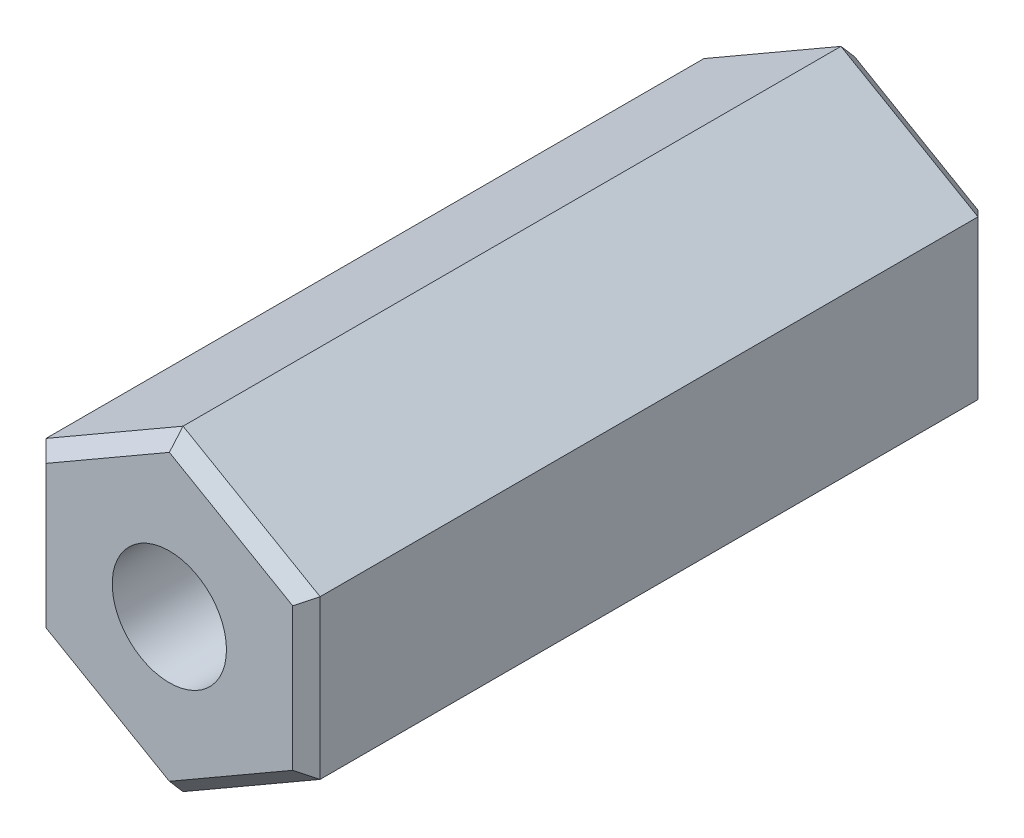
ISO-10303-21;
HEADER;
FILE_DESCRIPTION(('STEP AP214'),'2;1');
FILE_NAME('part.step','',(''),(''),'','','');
FILE_SCHEMA(('AUTOMOTIVE_DESIGN { 1 0 10303 214 1 1 1 1 }'));
ENDSEC;
DATA;
#1=APPLICATION_CONTEXT('core data for automotive mechanical design processes');
#2=APPLICATION_PROTOCOL_DEFINITION('international standard','automotive_design',2000,#1);
#3=PRODUCT_CONTEXT('',#1,'mechanical');
#4=PRODUCT('Part','Part','',(#3));
#5=PRODUCT_RELATED_PRODUCT_CATEGORY('part','',(#4));
#6=PRODUCT_DEFINITION_FORMATION('','',#4);
#7=PRODUCT_DEFINITION_CONTEXT('part definition',#1,'design');
#8=PRODUCT_DEFINITION('design','',#6,#7);
#9=PRODUCT_DEFINITION_SHAPE('','',#8);
#10=(LENGTH_UNIT() NAMED_UNIT(*) SI_UNIT(.MILLI.,.METRE.));
#11=(NAMED_UNIT(*) PLANE_ANGLE_UNIT() SI_UNIT($,.RADIAN.));
#12=(NAMED_UNIT(*) SI_UNIT($,.STERADIAN.) SOLID_ANGLE_UNIT());
#13=UNCERTAINTY_MEASURE_WITH_UNIT(LENGTH_MEASURE(1.E-05),#10,'distance_accuracy_value','');
#14=(GEOMETRIC_REPRESENTATION_CONTEXT(3) GLOBAL_UNCERTAINTY_ASSIGNED_CONTEXT((#13)) GLOBAL_UNIT_ASSIGNED_CONTEXT((#10,
#11,#12)) REPRESENTATION_CONTEXT('',''));
#15=CARTESIAN_POINT('',(0.,0.,0.));
#16=DIRECTION('',(0.,0.,1.));
#17=DIRECTION('',(1.,0.,0.));
#18=AXIS2_PLACEMENT_3D('',#15,#16,#17);
#19=CARTESIAN_POINT('',(3.00000000000002,1.7320508075689,15.));
#20=DIRECTION('',(-0.5,-0.866025403784438,0.));
#21=DIRECTION('',(0.866025403784439,-0.5,0.));
#22=AXIS2_PLACEMENT_3D('',#19,#20,#21);
#23=PLANE('',#22);
#24=DIRECTION('',(0.,0.,-1.));
#25=VECTOR('',#24,1.);
#26=CARTESIAN_POINT('',(3.00000000000002,1.7320508075689,15.));
#27=LINE('',#26,#25);
#28=CARTESIAN_POINT('',(3.00000000000002,1.7320508075689,14.7));
#29=VERTEX_POINT('',#28);
#30=CARTESIAN_POINT('',(3.00000000000002,1.7320508075689,0.3));
#31=VERTEX_POINT('',#30);
#32=EDGE_CURVE('E205',#29,#31,#27,.T.);
#33=ORIENTED_EDGE('',*,*,#32,.T.);
#34=DIRECTION('',(-0.866025403784439,0.5,0.));
#35=VECTOR('',#34,1.);
#36=CARTESIAN_POINT('',(3.00000000000002,1.7320508075689,0.3));
#37=LINE('',#36,#35);
#38=CARTESIAN_POINT('',(0.,3.46410161513776,0.3));
#39=VERTEX_POINT('',#38);
#40=EDGE_CURVE('E276',#31,#39,#37,.T.);
#41=ORIENTED_EDGE('',*,*,#40,.T.);
#42=DIRECTION('',(0.,0.,-1.));
#43=VECTOR('',#42,1.);
#44=CARTESIAN_POINT('',(0.,3.46410161513776,15.));
#45=LINE('',#44,#43);
#46=CARTESIAN_POINT('',(0.,3.46410161513776,14.7));
#47=VERTEX_POINT('',#46);
#48=EDGE_CURVE('E224',#47,#39,#45,.T.);
#49=ORIENTED_EDGE('',*,*,#48,.F.);
#50=DIRECTION('',(0.866025403784439,-0.5,0.));
#51=VECTOR('',#50,1.);
#52=CARTESIAN_POINT('',(3.00000000000002,1.7320508075689,14.7));
#53=LINE('',#52,#51);
#54=EDGE_CURVE('E273',#47,#29,#53,.T.);
#55=ORIENTED_EDGE('',*,*,#54,.T.);
#56=EDGE_LOOP('',(#33,#41,#49,#55));
#57=FACE_BOUND('',#56,.T.);
#58=ADVANCED_FACE('F58',(#57),#23,.F.);
#59=CARTESIAN_POINT('',(0.,3.46410161513776,15.));
#60=DIRECTION('',(0.5,-0.866025403784438,0.));
#61=DIRECTION('',(0.866025403784439,0.5,0.));
#62=AXIS2_PLACEMENT_3D('',#59,#60,#61);
#63=PLANE('',#62);
#64=ORIENTED_EDGE('',*,*,#48,.T.);
#65=DIRECTION('',(-0.866025403784439,-0.5,0.));
#66=VECTOR('',#65,1.);
#67=CARTESIAN_POINT('',(0.,3.46410161513776,0.3));
#68=LINE('',#67,#66);
#69=CARTESIAN_POINT('',(-3.,1.7320508075689,0.3));
#70=VERTEX_POINT('',#69);
#71=EDGE_CURVE('E282',#39,#70,#68,.T.);
#72=ORIENTED_EDGE('',*,*,#71,.T.);
#73=DIRECTION('',(0.,0.,-1.));
#74=VECTOR('',#73,1.);
#75=CARTESIAN_POINT('',(-3.,1.7320508075689,15.));
#76=LINE('',#75,#74);
#77=CARTESIAN_POINT('',(-3.,1.7320508075689,14.7));
#78=VERTEX_POINT('',#77);
#79=EDGE_CURVE('E220',#78,#70,#76,.T.);
#80=ORIENTED_EDGE('',*,*,#79,.F.);
#81=DIRECTION('',(0.866025403784439,0.5,0.));
#82=VECTOR('',#81,1.);
#83=CARTESIAN_POINT('',(0.,3.46410161513776,14.7));
#84=LINE('',#83,#82);
#85=EDGE_CURVE('E279',#78,#47,#84,.T.);
#86=ORIENTED_EDGE('',*,*,#85,.T.);
#87=EDGE_LOOP('',(#64,#72,#80,#86));
#88=FACE_BOUND('',#87,.T.);
#89=ADVANCED_FACE('F354',(#88),#63,.F.);
#90=CARTESIAN_POINT('',(-3.,1.7320508075689,15.));
#91=DIRECTION('',(1.,0.,0.));
#92=DIRECTION('',(0.,1.,0.));
#93=AXIS2_PLACEMENT_3D('',#90,#91,#92);
#94=PLANE('',#93);
#95=ORIENTED_EDGE('',*,*,#79,.T.);
#96=DIRECTION('',(0.,-1.,0.));
#97=VECTOR('',#96,1.);
#98=CARTESIAN_POINT('',(-3.,1.7320508075689,0.3));
#99=LINE('',#98,#97);
#100=CARTESIAN_POINT('',(-2.99999999999999,-1.73205080756887,0.3));
#101=VERTEX_POINT('',#100);
#102=EDGE_CURVE('E231',#70,#101,#99,.T.);
#103=ORIENTED_EDGE('',*,*,#102,.T.);
#104=DIRECTION('',(0.,0.,-1.));
#105=VECTOR('',#104,1.);
#106=CARTESIAN_POINT('',(-2.99999999999999,-1.73205080756887,15.));
#107=LINE('',#106,#105);
#108=CARTESIAN_POINT('',(-2.99999999999999,-1.73205080756887,14.7));
#109=VERTEX_POINT('',#108);
#110=EDGE_CURVE('E216',#109,#101,#107,.T.);
#111=ORIENTED_EDGE('',*,*,#110,.F.);
#112=DIRECTION('',(0.,1.,0.));
#113=VECTOR('',#112,1.);
#114=CARTESIAN_POINT('',(-3.,1.7320508075689,14.7));
#115=LINE('',#114,#113);
#116=EDGE_CURVE('E228',#109,#78,#115,.T.);
#117=ORIENTED_EDGE('',*,*,#116,.T.);
#118=EDGE_LOOP('',(#95,#103,#111,#117));
#119=FACE_BOUND('',#118,.T.);
#120=ADVANCED_FACE('F351',(#119),#94,.F.);
#121=CARTESIAN_POINT('',(-2.99999999999999,-1.73205080756887,15.));
#122=DIRECTION('',(0.5,0.866025403784439,0.));
#123=DIRECTION('',(-0.866025403784439,0.5,0.));
#124=AXIS2_PLACEMENT_3D('',#121,#122,#123);
#125=PLANE('',#124);
#126=ORIENTED_EDGE('',*,*,#110,.T.);
#127=DIRECTION('',(0.866025403784439,-0.5,0.));
#128=VECTOR('',#127,1.);
#129=CARTESIAN_POINT('',(-2.99999999999999,-1.73205080756887,0.3));
#130=LINE('',#129,#128);
#131=CARTESIAN_POINT('',(0.,-3.46410161513775,0.3));
#132=VERTEX_POINT('',#131);
#133=EDGE_CURVE('E257',#101,#132,#130,.T.);
#134=ORIENTED_EDGE('',*,*,#133,.T.);
#135=DIRECTION('',(0.,0.,-1.));
#136=VECTOR('',#135,1.);
#137=CARTESIAN_POINT('',(0.,-3.46410161513775,15.));
#138=LINE('',#137,#136);
#139=CARTESIAN_POINT('',(0.,-3.46410161513775,14.7));
#140=VERTEX_POINT('',#139);
#141=EDGE_CURVE('E213',#140,#132,#138,.T.);
#142=ORIENTED_EDGE('',*,*,#141,.F.);
#143=DIRECTION('',(-0.866025403784439,0.5,0.));
#144=VECTOR('',#143,1.);
#145=CARTESIAN_POINT('',(-2.99999999999999,-1.73205080756887,14.7));
#146=LINE('',#145,#144);
#147=EDGE_CURVE('E254',#140,#109,#146,.T.);
#148=ORIENTED_EDGE('',*,*,#147,.T.);
#149=EDGE_LOOP('',(#126,#134,#142,#148));
#150=FACE_BOUND('',#149,.T.);
#151=ADVANCED_FACE('F368',(#150),#125,.F.);
#152=CARTESIAN_POINT('',(0.,-3.46410161513775,15.));
#153=DIRECTION('',(-0.5,0.866025403784438,0.));
#154=DIRECTION('',(-0.866025403784439,-0.5,0.));
#155=AXIS2_PLACEMENT_3D('',#152,#153,#154);
#156=PLANE('',#155);
#157=ORIENTED_EDGE('',*,*,#141,.T.);
#158=DIRECTION('',(0.866025403784439,0.5,0.));
#159=VECTOR('',#158,1.);
#160=CARTESIAN_POINT('',(0.,-3.46410161513775,0.3));
#161=LINE('',#160,#159);
#162=CARTESIAN_POINT('',(3.,-1.73205080756887,0.3));
#163=VERTEX_POINT('',#162);
#164=EDGE_CURVE('E263',#132,#163,#161,.T.);
#165=ORIENTED_EDGE('',*,*,#164,.T.);
#166=DIRECTION('',(0.,0.,-1.));
#167=VECTOR('',#166,1.);
#168=CARTESIAN_POINT('',(3.,-1.73205080756887,15.));
#169=LINE('',#168,#167);
#170=CARTESIAN_POINT('',(3.,-1.73205080756887,14.7));
#171=VERTEX_POINT('',#170);
#172=EDGE_CURVE('E209',#171,#163,#169,.T.);
#173=ORIENTED_EDGE('',*,*,#172,.F.);
#174=DIRECTION('',(-0.866025403784439,-0.5,0.));
#175=VECTOR('',#174,1.);
#176=CARTESIAN_POINT('',(0.,-3.46410161513775,14.7));
#177=LINE('',#176,#175);
#178=EDGE_CURVE('E260',#171,#140,#177,.T.);
#179=ORIENTED_EDGE('',*,*,#178,.T.);
#180=EDGE_LOOP('',(#157,#165,#173,#179));
#181=FACE_BOUND('',#180,.T.);
#182=ADVANCED_FACE('F372',(#181),#156,.F.);
#183=CARTESIAN_POINT('',(3.,-1.73205080756887,15.));
#184=DIRECTION('',(-1.,0.,0.));
#185=DIRECTION('',(0.,0.,1.));
#186=AXIS2_PLACEMENT_3D('',#183,#184,#185);
#187=PLANE('',#186);
#188=ORIENTED_EDGE('',*,*,#172,.T.);
#189=DIRECTION('',(0.,1.,0.));
#190=VECTOR('',#189,1.);
#191=CARTESIAN_POINT('',(3.,-1.73205080756887,0.3));
#192=LINE('',#191,#190);
#193=EDGE_CURVE('E270',#163,#31,#192,.T.);
#194=ORIENTED_EDGE('',*,*,#193,.T.);
#195=ORIENTED_EDGE('',*,*,#32,.F.);
#196=DIRECTION('',(0.,-1.,0.));
#197=VECTOR('',#196,1.);
#198=CARTESIAN_POINT('',(3.,-1.73205080756887,14.7));
#199=LINE('',#198,#197);
#200=EDGE_CURVE('E266',#29,#171,#199,.T.);
#201=ORIENTED_EDGE('',*,*,#200,.T.);
#202=EDGE_LOOP('',(#188,#194,#195,#201));
#203=FACE_BOUND('',#202,.T.);
#204=ADVANCED_FACE('F395',(#203),#187,.F.);
#205=CARTESIAN_POINT('',(0.,0.,15.));
#206=DIRECTION('',(0.,0.,1.));
#207=DIRECTION('',(1.,0.,0.));
#208=AXIS2_PLACEMENT_3D('',#205,#206,#207);
#209=PLANE('',#208);
#210=DIRECTION('',(0.866025403784439,0.5,0.));
#211=VECTOR('',#210,1.);
#212=CARTESIAN_POINT('',(2.85000000000001,-1.47224318643353,15.));
#213=LINE('',#212,#211);
#214=CARTESIAN_POINT('',(0.,-3.11769145362396,15.));
#215=VERTEX_POINT('',#214);
#216=CARTESIAN_POINT('',(2.69999999999999,-1.55884572681199,15.));
#217=VERTEX_POINT('',#216);
#218=EDGE_CURVE('E68',#215,#217,#213,.T.);
#219=ORIENTED_EDGE('',*,*,#218,.T.);
#220=DIRECTION('',(0.,1.,0.));
#221=VECTOR('',#220,1.);
#222=CARTESIAN_POINT('',(2.69999999999999,1.73205080756888,15.));
#223=LINE('',#222,#221);
#224=CARTESIAN_POINT('',(2.69999999999999,1.55884572681199,15.));
#225=VERTEX_POINT('',#224);
#226=EDGE_CURVE('E13',#217,#225,#223,.T.);
#227=ORIENTED_EDGE('',*,*,#226,.T.);
#228=DIRECTION('',(-0.866025403784438,0.5,0.));
#229=VECTOR('',#228,1.);
#230=CARTESIAN_POINT('',(-0.149999999999997,3.20429399400242,15.));
#231=LINE('',#230,#229);
#232=CARTESIAN_POINT('',(0.,3.11769145362399,15.));
#233=VERTEX_POINT('',#232);
#234=EDGE_CURVE('E285',#225,#233,#231,.T.);
#235=ORIENTED_EDGE('',*,*,#234,.T.);
#236=DIRECTION('',(-0.866025403784438,-0.5,0.));
#237=VECTOR('',#236,1.);
#238=CARTESIAN_POINT('',(-2.84999999999998,1.47224318643356,15.));
#239=LINE('',#238,#237);
#240=CARTESIAN_POINT('',(-2.69999999999999,1.55884572681199,15.));
#241=VERTEX_POINT('',#240);
#242=EDGE_CURVE('E288',#233,#241,#239,.T.);
#243=ORIENTED_EDGE('',*,*,#242,.T.);
#244=DIRECTION('',(0.,-1.,0.));
#245=VECTOR('',#244,1.);
#246=CARTESIAN_POINT('',(-2.69999999999999,-1.73205080756887,15.));
#247=LINE('',#246,#245);
#248=CARTESIAN_POINT('',(-2.69999999999999,-1.55884572681199,15.));
#249=VERTEX_POINT('',#248);
#250=EDGE_CURVE('E291',#241,#249,#247,.T.);
#251=ORIENTED_EDGE('',*,*,#250,.T.);
#252=DIRECTION('',(0.866025403784438,-0.5,0.));
#253=VECTOR('',#252,1.);
#254=CARTESIAN_POINT('',(0.149999999999997,-3.20429399400242,15.));
#255=LINE('',#254,#253);
#256=EDGE_CURVE('E85',#249,#215,#255,.T.);
#257=ORIENTED_EDGE('',*,*,#256,.T.);
#258=EDGE_LOOP('',(#219,#227,#235,#243,#251,#257));
#259=FACE_BOUND('',#258,.T.);
#260=CARTESIAN_POINT('',(0.,0.,15.));
#261=DIRECTION('',(0.,0.,1.));
#262=DIRECTION('',(1.,0.,0.));
#263=AXIS2_PLACEMENT_3D('',#260,#261,#262);
#264=CIRCLE('',#263,1.24999999999999);
#265=CARTESIAN_POINT('',(1.24999999999999,0.,15.));
#266=VERTEX_POINT('',#265);
#267=EDGE_CURVE('E189',#266,#266,#264,.T.);
#268=ORIENTED_EDGE('',*,*,#267,.F.);
#269=EDGE_LOOP('',(#268));
#270=FACE_BOUND('',#269,.T.);
#271=ADVANCED_FACE('F552',(#259,#270),#209,.T.);
#272=CARTESIAN_POINT('',(0.,0.,0.));
#273=DIRECTION('',(0.,0.,1.));
#274=DIRECTION('',(1.,0.,0.));
#275=AXIS2_PLACEMENT_3D('',#272,#273,#274);
#276=PLANE('',#275);
#277=DIRECTION('',(-0.866025403784438,0.5,0.));
#278=VECTOR('',#277,1.);
#279=CARTESIAN_POINT('',(-1.34999999999999,-2.33826859021798,0.));
#280=LINE('',#279,#278);
#281=CARTESIAN_POINT('',(0.,-3.11769145362396,0.));
#282=VERTEX_POINT('',#281);
#283=CARTESIAN_POINT('',(-2.69999999999999,-1.55884572681199,0.));
#284=VERTEX_POINT('',#283);
#285=EDGE_CURVE('E247',#282,#284,#280,.T.);
#286=ORIENTED_EDGE('',*,*,#285,.T.);
#287=DIRECTION('',(0.,1.,0.));
#288=VECTOR('',#287,1.);
#289=CARTESIAN_POINT('',(-2.69999999999999,0.,0.));
#290=LINE('',#289,#288);
#291=CARTESIAN_POINT('',(-2.69999999999999,1.55884572681199,0.));
#292=VERTEX_POINT('',#291);
#293=EDGE_CURVE('E250',#284,#292,#290,.T.);
#294=ORIENTED_EDGE('',*,*,#293,.T.);
#295=DIRECTION('',(0.866025403784438,0.5,0.));
#296=VECTOR('',#295,1.);
#297=CARTESIAN_POINT('',(-1.35,2.338268590218,0.));
#298=LINE('',#297,#296);
#299=CARTESIAN_POINT('',(0.,3.11769145362399,0.));
#300=VERTEX_POINT('',#299);
#301=EDGE_CURVE('E235',#292,#300,#298,.T.);
#302=ORIENTED_EDGE('',*,*,#301,.T.);
#303=DIRECTION('',(0.866025403784438,-0.5,0.));
#304=VECTOR('',#303,1.);
#305=CARTESIAN_POINT('',(1.35,2.33826859021799,0.));
#306=LINE('',#305,#304);
#307=CARTESIAN_POINT('',(2.69999999999999,1.55884572681199,0.));
#308=VERTEX_POINT('',#307);
#309=EDGE_CURVE('E238',#300,#308,#306,.T.);
#310=ORIENTED_EDGE('',*,*,#309,.T.);
#311=DIRECTION('',(0.,-1.,0.));
#312=VECTOR('',#311,1.);
#313=CARTESIAN_POINT('',(2.69999999999999,0.,0.));
#314=LINE('',#313,#312);
#315=CARTESIAN_POINT('',(2.69999999999999,-1.55884572681199,0.));
#316=VERTEX_POINT('',#315);
#317=EDGE_CURVE('E241',#308,#316,#314,.T.);
#318=ORIENTED_EDGE('',*,*,#317,.T.);
#319=DIRECTION('',(-0.866025403784439,-0.5,0.));
#320=VECTOR('',#319,1.);
#321=CARTESIAN_POINT('',(1.35,-2.33826859021798,0.));
#322=LINE('',#321,#320);
#323=EDGE_CURVE('E244',#316,#282,#322,.T.);
#324=ORIENTED_EDGE('',*,*,#323,.T.);
#325=EDGE_LOOP('',(#286,#294,#302,#310,#318,#324));
#326=FACE_BOUND('',#325,.T.);
#327=CARTESIAN_POINT('',(0.,0.,0.));
#328=DIRECTION('',(0.,0.,-1.));
#329=DIRECTION('',(-1.,0.,0.));
#330=AXIS2_PLACEMENT_3D('',#327,#328,#329);
#331=CIRCLE('',#330,1.24999999999999);
#332=CARTESIAN_POINT('',(-1.24999999999999,0.,0.));
#333=VERTEX_POINT('',#332);
#334=EDGE_CURVE('E190',#333,#333,#331,.T.);
#335=ORIENTED_EDGE('',*,*,#334,.F.);
#336=EDGE_LOOP('',(#335));
#337=FACE_BOUND('',#336,.T.);
#338=ADVANCED_FACE('F384',(#326,#337),#276,.F.);
#339=CARTESIAN_POINT('',(0.,0.,9.));
#340=DIRECTION('',(0.,0.,1.));
#341=DIRECTION('',(1.,0.,0.));
#342=AXIS2_PLACEMENT_3D('',#339,#340,#341);
#343=CONICAL_SURFACE('',#342,1.25,1.02974425867665);
#344=CARTESIAN_POINT('',(0.,0.,8.24892422621555));
#345=VERTEX_POINT('',#344);
#346=VERTEX_LOOP('',#345);
#347=FACE_BOUND('',#346,.T.);
#348=CARTESIAN_POINT('',(0.,0.,9.));
#349=DIRECTION('',(0.,0.,1.));
#350=DIRECTION('',(1.,0.,0.));
#351=AXIS2_PLACEMENT_3D('',#348,#349,#350);
#352=CIRCLE('',#351,1.25);
#353=CARTESIAN_POINT('',(1.25,0.,9.));
#354=VERTEX_POINT('',#353);
#355=EDGE_CURVE('E195',#354,#354,#352,.T.);
#356=ORIENTED_EDGE('',*,*,#355,.T.);
#357=EDGE_LOOP('',(#356));
#358=FACE_BOUND('',#357,.T.);
#359=ADVANCED_FACE('F533',(#347,#358),#343,.F.);
#360=CARTESIAN_POINT('',(0.,0.,15.));
#361=DIRECTION('',(0.,0.,1.));
#362=DIRECTION('',(1.,0.,0.));
#363=AXIS2_PLACEMENT_3D('',#360,#361,#362);
#364=CYLINDRICAL_SURFACE('',#363,1.24999999999999);
#365=ORIENTED_EDGE('',*,*,#355,.F.);
#366=EDGE_LOOP('',(#365));
#367=FACE_BOUND('',#366,.T.);
#368=ORIENTED_EDGE('',*,*,#267,.T.);
#369=EDGE_LOOP('',(#368));
#370=FACE_BOUND('',#369,.T.);
#371=ADVANCED_FACE('F182',(#367,#370),#364,.F.);
#372=CARTESIAN_POINT('',(0.,0.,7.));
#373=DIRECTION('',(0.,0.,-1.));
#374=DIRECTION('',(-1.,0.,0.));
#375=AXIS2_PLACEMENT_3D('',#372,#373,#374);
#376=CONICAL_SURFACE('',#375,1.25,1.02974425867665);
#377=CARTESIAN_POINT('',(0.,0.,7.75107577378445));
#378=VERTEX_POINT('',#377);
#379=VERTEX_LOOP('',#378);
#380=FACE_BOUND('',#379,.T.);
#381=CARTESIAN_POINT('',(0.,0.,7.));
#382=DIRECTION('',(0.,0.,-1.));
#383=DIRECTION('',(-1.,0.,0.));
#384=AXIS2_PLACEMENT_3D('',#381,#382,#383);
#385=CIRCLE('',#384,1.25);
#386=CARTESIAN_POINT('',(-1.25,0.,7.));
#387=VERTEX_POINT('',#386);
#388=EDGE_CURVE('E186',#387,#387,#385,.T.);
#389=ORIENTED_EDGE('',*,*,#388,.T.);
#390=EDGE_LOOP('',(#389));
#391=FACE_BOUND('',#390,.T.);
#392=ADVANCED_FACE('F178',(#380,#391),#376,.F.);
#393=CARTESIAN_POINT('',(0.,0.,0.));
#394=DIRECTION('',(0.,0.,-1.));
#395=DIRECTION('',(-1.,0.,0.));
#396=AXIS2_PLACEMENT_3D('',#393,#394,#395);
#397=CYLINDRICAL_SURFACE('',#396,1.24999999999999);
#398=ORIENTED_EDGE('',*,*,#388,.F.);
#399=EDGE_LOOP('',(#398));
#400=FACE_BOUND('',#399,.T.);
#401=ORIENTED_EDGE('',*,*,#334,.T.);
#402=EDGE_LOOP('',(#401));
#403=FACE_BOUND('',#402,.T.);
#404=ADVANCED_FACE('F181',(#400,#403),#397,.F.);
#405=CARTESIAN_POINT('',(3.,-1.73205080756887,0.3));
#406=DIRECTION('',(-0.707106781186545,0.,0.70710678118655));
#407=DIRECTION('',(0.,1.,0.));
#408=AXIS2_PLACEMENT_3D('',#405,#406,#407);
#409=PLANE('',#408);
#410=DIRECTION('',(-0.654653670707979,0.377964473009228,-0.654653670707975));
#411=VECTOR('',#410,1.);
#412=CARTESIAN_POINT('',(3.,-1.73205080756887,0.3));
#413=LINE('',#412,#411);
#414=EDGE_CURVE('E312',#316,#163,#413,.F.);
#415=ORIENTED_EDGE('',*,*,#414,.F.);
#416=ORIENTED_EDGE('',*,*,#317,.F.);
#417=DIRECTION('',(-0.654653670707979,-0.377964473009228,-0.654653670707975));
#418=VECTOR('',#417,1.);
#419=CARTESIAN_POINT('',(3.00000000000002,1.7320508075689,0.3));
#420=LINE('',#419,#418);
#421=EDGE_CURVE('E199',#31,#308,#420,.T.);
#422=ORIENTED_EDGE('',*,*,#421,.F.);
#423=ORIENTED_EDGE('',*,*,#193,.F.);
#424=EDGE_LOOP('',(#415,#416,#422,#423));
#425=FACE_BOUND('',#424,.T.);
#426=ADVANCED_FACE('F391',(#425),#409,.F.);
#427=CARTESIAN_POINT('',(3.00000000000002,1.7320508075689,0.3));
#428=DIRECTION('',(-0.353553390593273,-0.612372435695793,0.707106781186549));
#429=DIRECTION('',(-0.866025403784439,0.5,0.));
#430=AXIS2_PLACEMENT_3D('',#427,#428,#429);
#431=PLANE('',#430);
#432=ORIENTED_EDGE('',*,*,#421,.T.);
#433=ORIENTED_EDGE('',*,*,#309,.F.);
#434=DIRECTION('',(0.,-0.755928946018456,-0.654653670707975));
#435=VECTOR('',#434,1.);
#436=CARTESIAN_POINT('',(0.,3.46410161513776,0.3));
#437=LINE('',#436,#435);
#438=EDGE_CURVE('E308',#39,#300,#437,.T.);
#439=ORIENTED_EDGE('',*,*,#438,.F.);
#440=ORIENTED_EDGE('',*,*,#40,.F.);
#441=EDGE_LOOP('',(#432,#433,#439,#440));
#442=FACE_BOUND('',#441,.T.);
#443=ADVANCED_FACE('F434',(#442),#431,.F.);
#444=CARTESIAN_POINT('',(0.,-3.46410161513775,0.3));
#445=DIRECTION('',(-0.353553390593273,0.612372435695793,0.70710678118655));
#446=DIRECTION('',(0.866025403784439,0.5,0.));
#447=AXIS2_PLACEMENT_3D('',#444,#445,#446);
#448=PLANE('',#447);
#449=ORIENTED_EDGE('',*,*,#414,.T.);
#450=ORIENTED_EDGE('',*,*,#164,.F.);
#451=DIRECTION('',(0.,0.755928946018456,-0.654653670707975));
#452=VECTOR('',#451,1.);
#453=CARTESIAN_POINT('',(0.,-3.46410161513775,0.3));
#454=LINE('',#453,#452);
#455=EDGE_CURVE('E304',#282,#132,#454,.F.);
#456=ORIENTED_EDGE('',*,*,#455,.F.);
#457=ORIENTED_EDGE('',*,*,#323,.F.);
#458=EDGE_LOOP('',(#449,#450,#456,#457));
#459=FACE_BOUND('',#458,.T.);
#460=ADVANCED_FACE('F377',(#459),#448,.F.);
#461=CARTESIAN_POINT('',(0.,3.46410161513776,0.3));
#462=DIRECTION('',(0.353553390593273,-0.612372435695793,0.707106781186549));
#463=DIRECTION('',(-0.866025403784439,-0.5,0.));
#464=AXIS2_PLACEMENT_3D('',#461,#462,#463);
#465=PLANE('',#464);
#466=ORIENTED_EDGE('',*,*,#438,.T.);
#467=ORIENTED_EDGE('',*,*,#301,.F.);
#468=DIRECTION('',(-0.654653670707978,0.377964473009228,0.654653670707975));
#469=VECTOR('',#468,1.);
#470=CARTESIAN_POINT('',(-2.14285714285713,1.23717914826349,-0.557142857142856));
#471=LINE('',#470,#469);
#472=EDGE_CURVE('E301',#70,#292,#471,.F.);
#473=ORIENTED_EDGE('',*,*,#472,.F.);
#474=ORIENTED_EDGE('',*,*,#71,.F.);
#475=EDGE_LOOP('',(#466,#467,#473,#474));
#476=FACE_BOUND('',#475,.T.);
#477=ADVANCED_FACE('F359',(#476),#465,.F.);
#478=CARTESIAN_POINT('',(-2.99999999999999,-1.73205080756887,0.3));
#479=DIRECTION('',(0.353553390593273,0.612372435695793,0.707106781186549));
#480=DIRECTION('',(0.866025403784439,-0.5,0.));
#481=AXIS2_PLACEMENT_3D('',#478,#479,#480);
#482=PLANE('',#481);
#483=ORIENTED_EDGE('',*,*,#455,.T.);
#484=ORIENTED_EDGE('',*,*,#133,.F.);
#485=DIRECTION('',(0.654653670707979,0.377964473009228,-0.654653670707975));
#486=VECTOR('',#485,1.);
#487=CARTESIAN_POINT('',(-2.99999999999999,-1.73205080756887,0.3));
#488=LINE('',#487,#486);
#489=EDGE_CURVE('E298',#284,#101,#488,.F.);
#490=ORIENTED_EDGE('',*,*,#489,.F.);
#491=ORIENTED_EDGE('',*,*,#285,.F.);
#492=EDGE_LOOP('',(#483,#484,#490,#491));
#493=FACE_BOUND('',#492,.T.);
#494=ADVANCED_FACE('F382',(#493),#482,.F.);
#495=CARTESIAN_POINT('',(-3.,1.7320508075689,0.3));
#496=DIRECTION('',(0.707106781186545,0.,0.70710678118655));
#497=DIRECTION('',(0.,-1.,0.));
#498=AXIS2_PLACEMENT_3D('',#495,#496,#497);
#499=PLANE('',#498);
#500=ORIENTED_EDGE('',*,*,#472,.T.);
#501=ORIENTED_EDGE('',*,*,#293,.F.);
#502=ORIENTED_EDGE('',*,*,#489,.T.);
#503=ORIENTED_EDGE('',*,*,#102,.F.);
#504=EDGE_LOOP('',(#500,#501,#502,#503));
#505=FACE_BOUND('',#504,.T.);
#506=ADVANCED_FACE('F364',(#505),#499,.F.);
#507=CARTESIAN_POINT('',(-2.69999999999999,0.,15.));
#508=DIRECTION('',(-0.707106781186549,0.,0.707106781186546));
#509=DIRECTION('',(0.,1.,0.));
#510=AXIS2_PLACEMENT_3D('',#507,#508,#509);
#511=PLANE('',#510);
#512=DIRECTION('',(0.654653670707976,-0.377964473009226,0.654653670707979));
#513=VECTOR('',#512,1.);
#514=CARTESIAN_POINT('',(-2.31428571428571,1.33615348012457,15.3857142857143));
#515=LINE('',#514,#513);
#516=EDGE_CURVE('E332',#78,#241,#515,.T.);
#517=ORIENTED_EDGE('',*,*,#516,.F.);
#518=ORIENTED_EDGE('',*,*,#116,.F.);
#519=DIRECTION('',(0.654653670707976,0.377964473009226,0.654653670707979));
#520=VECTOR('',#519,1.);
#521=CARTESIAN_POINT('',(-2.31428571428571,-1.33615348012456,15.3857142857143));
#522=LINE('',#521,#520);
#523=EDGE_CURVE('E62',#249,#109,#522,.F.);
#524=ORIENTED_EDGE('',*,*,#523,.F.);
#525=ORIENTED_EDGE('',*,*,#250,.F.);
#526=EDGE_LOOP('',(#517,#518,#524,#525));
#527=FACE_BOUND('',#526,.T.);
#528=ADVANCED_FACE('F60',(#527),#511,.T.);
#529=CARTESIAN_POINT('',(-1.34999999999999,-2.33826859021798,15.));
#530=DIRECTION('',(-0.353553390593275,-0.612372435695796,0.707106781186546));
#531=DIRECTION('',(-0.866025403784439,0.5,0.));
#532=AXIS2_PLACEMENT_3D('',#529,#530,#531);
#533=PLANE('',#532);
#534=ORIENTED_EDGE('',*,*,#523,.T.);
#535=ORIENTED_EDGE('',*,*,#147,.F.);
#536=DIRECTION('',(0.,0.755928946018453,0.654653670707979));
#537=VECTOR('',#536,1.);
#538=CARTESIAN_POINT('',(0.,-2.67230696024913,15.3857142857143));
#539=LINE('',#538,#537);
#540=EDGE_CURVE('E329',#215,#140,#539,.F.);
#541=ORIENTED_EDGE('',*,*,#540,.F.);
#542=ORIENTED_EDGE('',*,*,#256,.F.);
#543=EDGE_LOOP('',(#534,#535,#541,#542));
#544=FACE_BOUND('',#543,.T.);
#545=ADVANCED_FACE('F344',(#544),#533,.T.);
#546=CARTESIAN_POINT('',(-1.35,2.338268590218,15.));
#547=DIRECTION('',(-0.353553390593275,0.612372435695796,0.707106781186545));
#548=DIRECTION('',(0.866025403784439,0.5,0.));
#549=AXIS2_PLACEMENT_3D('',#546,#547,#548);
#550=PLANE('',#549);
#551=ORIENTED_EDGE('',*,*,#516,.T.);
#552=ORIENTED_EDGE('',*,*,#242,.F.);
#553=DIRECTION('',(0.,-0.755928946018453,0.654653670707979));
#554=VECTOR('',#553,1.);
#555=CARTESIAN_POINT('',(0.,2.67230696024913,15.3857142857143));
#556=LINE('',#555,#554);
#557=EDGE_CURVE('E325',#47,#233,#556,.T.);
#558=ORIENTED_EDGE('',*,*,#557,.F.);
#559=ORIENTED_EDGE('',*,*,#85,.F.);
#560=EDGE_LOOP('',(#551,#552,#558,#559));
#561=FACE_BOUND('',#560,.T.);
#562=ADVANCED_FACE('F410',(#561),#550,.T.);
#563=CARTESIAN_POINT('',(1.35,-2.33826859021798,15.));
#564=DIRECTION('',(0.353553390593275,-0.612372435695796,0.707106781186546));
#565=DIRECTION('',(-0.866025403784439,-0.5,0.));
#566=AXIS2_PLACEMENT_3D('',#563,#564,#565);
#567=PLANE('',#566);
#568=ORIENTED_EDGE('',*,*,#540,.T.);
#569=ORIENTED_EDGE('',*,*,#178,.F.);
#570=DIRECTION('',(-0.654653670707976,0.377964473009226,0.654653670707979));
#571=VECTOR('',#570,1.);
#572=CARTESIAN_POINT('',(2.31428571428573,-1.33615348012454,15.3857142857143));
#573=LINE('',#572,#571);
#574=EDGE_CURVE('E322',#217,#171,#573,.F.);
#575=ORIENTED_EDGE('',*,*,#574,.F.);
#576=ORIENTED_EDGE('',*,*,#218,.F.);
#577=EDGE_LOOP('',(#568,#569,#575,#576));
#578=FACE_BOUND('',#577,.T.);
#579=ADVANCED_FACE('F408',(#578),#567,.T.);
#580=CARTESIAN_POINT('',(1.35,2.33826859021799,15.));
#581=DIRECTION('',(0.353553390593275,0.612372435695796,0.707106781186546));
#582=DIRECTION('',(0.866025403784439,-0.5,0.));
#583=AXIS2_PLACEMENT_3D('',#580,#581,#582);
#584=PLANE('',#583);
#585=ORIENTED_EDGE('',*,*,#557,.T.);
#586=ORIENTED_EDGE('',*,*,#234,.F.);
#587=DIRECTION('',(0.654653670707976,0.377964473009226,-0.654653670707979));
#588=VECTOR('',#587,1.);
#589=CARTESIAN_POINT('',(2.31428571428573,1.33615348012457,15.3857142857143));
#590=LINE('',#589,#588);
#591=EDGE_CURVE('E319',#29,#225,#590,.F.);
#592=ORIENTED_EDGE('',*,*,#591,.F.);
#593=ORIENTED_EDGE('',*,*,#54,.F.);
#594=EDGE_LOOP('',(#585,#586,#592,#593));
#595=FACE_BOUND('',#594,.T.);
#596=ADVANCED_FACE('F402',(#595),#584,.T.);
#597=CARTESIAN_POINT('',(2.69999999999999,0.,15.));
#598=DIRECTION('',(0.707106781186549,0.,0.707106781186546));
#599=DIRECTION('',(0.,-1.,0.));
#600=AXIS2_PLACEMENT_3D('',#597,#598,#599);
#601=PLANE('',#600);
#602=ORIENTED_EDGE('',*,*,#574,.T.);
#603=ORIENTED_EDGE('',*,*,#200,.F.);
#604=ORIENTED_EDGE('',*,*,#591,.T.);
#605=ORIENTED_EDGE('',*,*,#226,.F.);
#606=EDGE_LOOP('',(#602,#603,#604,#605));
#607=FACE_BOUND('',#606,.T.);
#608=ADVANCED_FACE('F406',(#607),#601,.T.);
#609=CLOSED_SHELL('',(#58,#89,#120,#151,#182,#204,#271,#338,#359,#371,#392,#404,#426,#443,#460,
#477,#494,#506,#528,#545,#562,#579,#596,#608));
#610=MANIFOLD_SOLID_BREP('B2',#609);
#611=ADVANCED_BREP_SHAPE_REPRESENTATION('',(#18,#610),#14);
#612=SHAPE_DEFINITION_REPRESENTATION(#9,#611);
ENDSEC;
END-ISO-10303-21;
